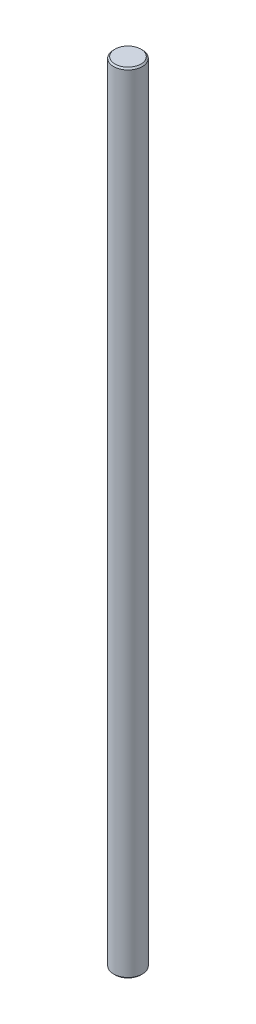
ISO-10303-21;
HEADER;
FILE_DESCRIPTION(('STEP AP214'),'2;1');
FILE_NAME('part.step','',(''),(''),'','','');
FILE_SCHEMA(('AUTOMOTIVE_DESIGN { 1 0 10303 214 1 1 1 1 }'));
ENDSEC;
DATA;
#1=APPLICATION_CONTEXT('core data for automotive mechanical design processes');
#2=APPLICATION_PROTOCOL_DEFINITION('international standard','automotive_design',2000,#1);
#3=PRODUCT_CONTEXT('',#1,'mechanical');
#4=PRODUCT('Part','Part','',(#3));
#5=PRODUCT_RELATED_PRODUCT_CATEGORY('part','',(#4));
#6=PRODUCT_DEFINITION_FORMATION('','',#4);
#7=PRODUCT_DEFINITION_CONTEXT('part definition',#1,'design');
#8=PRODUCT_DEFINITION('design','',#6,#7);
#9=PRODUCT_DEFINITION_SHAPE('','',#8);
#10=(LENGTH_UNIT() NAMED_UNIT(*) SI_UNIT(.MILLI.,.METRE.));
#11=(NAMED_UNIT(*) PLANE_ANGLE_UNIT() SI_UNIT($,.RADIAN.));
#12=(NAMED_UNIT(*) SI_UNIT($,.STERADIAN.) SOLID_ANGLE_UNIT());
#13=UNCERTAINTY_MEASURE_WITH_UNIT(LENGTH_MEASURE(1.E-05),#10,'distance_accuracy_value','');
#14=(GEOMETRIC_REPRESENTATION_CONTEXT(3) GLOBAL_UNCERTAINTY_ASSIGNED_CONTEXT((#13)) GLOBAL_UNIT_ASSIGNED_CONTEXT((#10,
#11,#12)) REPRESENTATION_CONTEXT('',''));
#15=CARTESIAN_POINT('',(0.,0.,0.));
#16=DIRECTION('',(0.,0.,1.));
#17=DIRECTION('',(1.,0.,0.));
#18=AXIS2_PLACEMENT_3D('',#15,#16,#17);
#19=CARTESIAN_POINT('',(0.,-174.307396977621,0.));
#20=DIRECTION('',(0.,1.,0.));
#21=DIRECTION('',(0.,0.,1.));
#22=AXIS2_PLACEMENT_3D('',#19,#20,#21);
#23=CYLINDRICAL_SURFACE('',#22,5.);
#24=CARTESIAN_POINT('',(0.,99.5,0.));
#25=DIRECTION('',(0.,1.,0.));
#26=DIRECTION('',(0.,0.,1.));
#27=AXIS2_PLACEMENT_3D('',#24,#25,#26);
#28=CIRCLE('',#27,5.);
#29=CARTESIAN_POINT('',(0.,99.5,5.));
#30=VERTEX_POINT('',#29);
#31=EDGE_CURVE('E38',#30,#30,#28,.F.);
#32=ORIENTED_EDGE('',*,*,#31,.T.);
#33=EDGE_LOOP('',(#32));
#34=FACE_BOUND('',#33,.T.);
#35=CARTESIAN_POINT('',(0.,-173.807396977622,0.));
#36=DIRECTION('',(0.,1.,0.));
#37=DIRECTION('',(0.,0.,1.));
#38=AXIS2_PLACEMENT_3D('',#35,#36,#37);
#39=CIRCLE('',#38,5.);
#40=CARTESIAN_POINT('',(0.,-173.807396977622,5.));
#41=VERTEX_POINT('',#40);
#42=EDGE_CURVE('E42',#41,#41,#39,.T.);
#43=ORIENTED_EDGE('',*,*,#42,.T.);
#44=EDGE_LOOP('',(#43));
#45=FACE_BOUND('',#44,.T.);
#46=ADVANCED_FACE('F31',(#34,#45),#23,.T.);
#47=CARTESIAN_POINT('',(0.,-174.307396977621,0.));
#48=DIRECTION('',(0.,1.,0.));
#49=DIRECTION('',(0.,0.,1.));
#50=AXIS2_PLACEMENT_3D('',#47,#48,#49);
#51=PLANE('',#50);
#52=CARTESIAN_POINT('',(0.,-174.307396977621,0.));
#53=DIRECTION('',(0.,1.,0.));
#54=DIRECTION('',(0.,0.,1.));
#55=AXIS2_PLACEMENT_3D('',#52,#53,#54);
#56=CIRCLE('',#55,4.50000000000006);
#57=CARTESIAN_POINT('',(0.,-174.307396977621,4.50000000000006));
#58=VERTEX_POINT('',#57);
#59=EDGE_CURVE('E10',#58,#58,#56,.F.);
#60=ORIENTED_EDGE('',*,*,#59,.T.);
#61=EDGE_LOOP('',(#60));
#62=FACE_BOUND('',#61,.T.);
#63=ADVANCED_FACE('F62',(#62),#51,.F.);
#64=CARTESIAN_POINT('',(0.,100.,0.));
#65=DIRECTION('',(0.,1.,0.));
#66=DIRECTION('',(0.,0.,1.));
#67=AXIS2_PLACEMENT_3D('',#64,#65,#66);
#68=PLANE('',#67);
#69=CARTESIAN_POINT('',(0.,100.,0.));
#70=DIRECTION('',(0.,1.,0.));
#71=DIRECTION('',(0.,0.,1.));
#72=AXIS2_PLACEMENT_3D('',#69,#70,#71);
#73=CIRCLE('',#72,4.50000000000003);
#74=CARTESIAN_POINT('',(0.,100.,4.50000000000003));
#75=VERTEX_POINT('',#74);
#76=EDGE_CURVE('E46',#75,#75,#73,.T.);
#77=ORIENTED_EDGE('',*,*,#76,.T.);
#78=EDGE_LOOP('',(#77));
#79=FACE_BOUND('',#78,.T.);
#80=ADVANCED_FACE('F52',(#79),#68,.T.);
#81=CARTESIAN_POINT('',(0.,100.,0.));
#82=DIRECTION('',(0.,-1.,0.));
#83=DIRECTION('',(0.,0.,-1.));
#84=AXIS2_PLACEMENT_3D('',#81,#82,#83);
#85=CONICAL_SURFACE('',#84,4.5,0.785398163397444);
#86=ORIENTED_EDGE('',*,*,#31,.F.);
#87=EDGE_LOOP('',(#86));
#88=FACE_BOUND('',#87,.T.);
#89=ORIENTED_EDGE('',*,*,#76,.F.);
#90=EDGE_LOOP('',(#89));
#91=FACE_BOUND('',#90,.T.);
#92=ADVANCED_FACE('F54',(#88,#91),#85,.T.);
#93=CARTESIAN_POINT('',(0.,-173.807396977622,0.));
#94=DIRECTION('',(0.,1.,0.));
#95=DIRECTION('',(0.,0.,1.));
#96=AXIS2_PLACEMENT_3D('',#93,#94,#95);
#97=CONICAL_SURFACE('',#96,5.,0.785398163397499);
#98=ORIENTED_EDGE('',*,*,#59,.F.);
#99=EDGE_LOOP('',(#98));
#100=FACE_BOUND('',#99,.T.);
#101=ORIENTED_EDGE('',*,*,#42,.F.);
#102=EDGE_LOOP('',(#101));
#103=FACE_BOUND('',#102,.T.);
#104=ADVANCED_FACE('F33',(#100,#103),#97,.T.);
#105=CLOSED_SHELL('',(#46,#63,#80,#92,#104));
#106=MANIFOLD_SOLID_BREP('B2',#105);
#107=ADVANCED_BREP_SHAPE_REPRESENTATION('',(#18,#106),#14);
#108=SHAPE_DEFINITION_REPRESENTATION(#9,#107);
ENDSEC;
END-ISO-10303-21;
